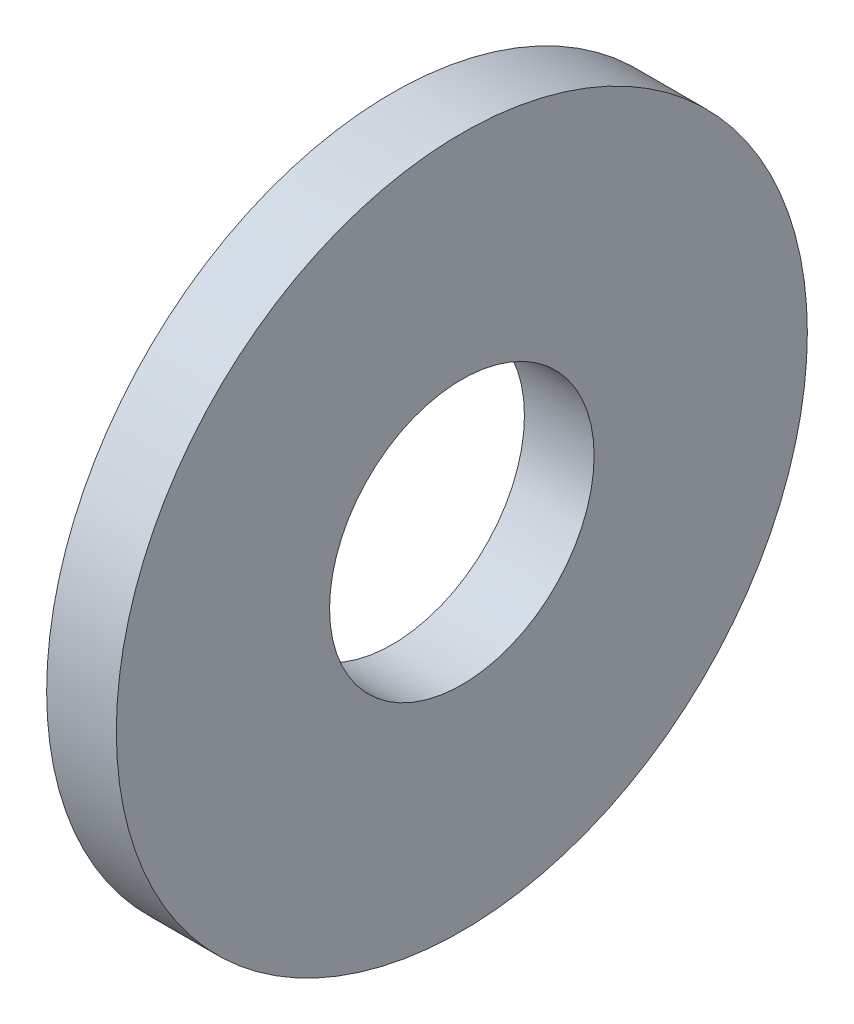
ISO-10303-21;
HEADER;
FILE_DESCRIPTION(('STEP AP214'),'2;1');
FILE_NAME('part.step','',(''),(''),'','','');
FILE_SCHEMA(('AUTOMOTIVE_DESIGN { 1 0 10303 214 1 1 1 1 }'));
ENDSEC;
DATA;
#1=APPLICATION_CONTEXT('core data for automotive mechanical design processes');
#2=APPLICATION_PROTOCOL_DEFINITION('international standard','automotive_design',2000,#1);
#3=PRODUCT_CONTEXT('',#1,'mechanical');
#4=PRODUCT('Part','Part','',(#3));
#5=PRODUCT_RELATED_PRODUCT_CATEGORY('part','',(#4));
#6=PRODUCT_DEFINITION_FORMATION('','',#4);
#7=PRODUCT_DEFINITION_CONTEXT('part definition',#1,'design');
#8=PRODUCT_DEFINITION('design','',#6,#7);
#9=PRODUCT_DEFINITION_SHAPE('','',#8);
#10=(LENGTH_UNIT() NAMED_UNIT(*) SI_UNIT(.MILLI.,.METRE.));
#11=(NAMED_UNIT(*) PLANE_ANGLE_UNIT() SI_UNIT($,.RADIAN.));
#12=(NAMED_UNIT(*) SI_UNIT($,.STERADIAN.) SOLID_ANGLE_UNIT());
#13=UNCERTAINTY_MEASURE_WITH_UNIT(LENGTH_MEASURE(1.E-05),#10,'distance_accuracy_value','');
#14=(GEOMETRIC_REPRESENTATION_CONTEXT(3) GLOBAL_UNCERTAINTY_ASSIGNED_CONTEXT((#13)) GLOBAL_UNIT_ASSIGNED_CONTEXT((#10,
#11,#12)) REPRESENTATION_CONTEXT('',''));
#15=CARTESIAN_POINT('',(0.,0.,0.));
#16=DIRECTION('',(0.,0.,1.));
#17=DIRECTION('',(1.,0.,0.));
#18=AXIS2_PLACEMENT_3D('',#15,#16,#17);
#19=CARTESIAN_POINT('',(1.8796,0.,0.));
#20=DIRECTION('',(1.,0.,0.));
#21=DIRECTION('',(0.,0.,-1.));
#22=AXIS2_PLACEMENT_3D('',#19,#20,#21);
#23=PLANE('',#22);
#24=CARTESIAN_POINT('',(1.8796,0.,0.));
#25=DIRECTION('',(1.,0.,0.));
#26=DIRECTION('',(0.,0.,-1.));
#27=AXIS2_PLACEMENT_3D('',#24,#25,#26);
#28=CIRCLE('',#27,9.3218);
#29=CARTESIAN_POINT('',(1.8796,0.,-9.3218));
#30=VERTEX_POINT('',#29);
#31=EDGE_CURVE('E10',#30,#30,#28,.T.);
#32=ORIENTED_EDGE('',*,*,#31,.T.);
#33=EDGE_LOOP('',(#32));
#34=FACE_BOUND('',#33,.T.);
#35=CARTESIAN_POINT('',(1.8796,0.,0.));
#36=DIRECTION('',(1.,0.,0.));
#37=DIRECTION('',(0.,0.,-1.));
#38=AXIS2_PLACEMENT_3D('',#35,#36,#37);
#39=CIRCLE('',#38,3.5687);
#40=CARTESIAN_POINT('',(1.8796,0.,-3.5687));
#41=VERTEX_POINT('',#40);
#42=EDGE_CURVE('E41',#41,#41,#39,.T.);
#43=ORIENTED_EDGE('',*,*,#42,.F.);
#44=EDGE_LOOP('',(#43));
#45=FACE_BOUND('',#44,.T.);
#46=ADVANCED_FACE('F30',(#34,#45),#23,.T.);
#47=CARTESIAN_POINT('',(0.,0.,0.));
#48=DIRECTION('',(1.,0.,0.));
#49=DIRECTION('',(0.,0.,-1.));
#50=AXIS2_PLACEMENT_3D('',#47,#48,#49);
#51=PLANE('',#50);
#52=CARTESIAN_POINT('',(0.,0.,0.));
#53=DIRECTION('',(1.,0.,0.));
#54=DIRECTION('',(0.,0.,-1.));
#55=AXIS2_PLACEMENT_3D('',#52,#53,#54);
#56=CIRCLE('',#55,9.3218);
#57=CARTESIAN_POINT('',(0.,0.,-9.3218));
#58=VERTEX_POINT('',#57);
#59=EDGE_CURVE('E34',#58,#58,#56,.T.);
#60=ORIENTED_EDGE('',*,*,#59,.F.);
#61=EDGE_LOOP('',(#60));
#62=FACE_BOUND('',#61,.T.);
#63=CARTESIAN_POINT('',(0.,0.,0.));
#64=DIRECTION('',(1.,0.,0.));
#65=DIRECTION('',(0.,0.,-1.));
#66=AXIS2_PLACEMENT_3D('',#63,#64,#65);
#67=CIRCLE('',#66,3.5687);
#68=CARTESIAN_POINT('',(0.,0.,-3.5687));
#69=VERTEX_POINT('',#68);
#70=EDGE_CURVE('E43',#69,#69,#67,.T.);
#71=ORIENTED_EDGE('',*,*,#70,.T.);
#72=EDGE_LOOP('',(#71));
#73=FACE_BOUND('',#72,.T.);
#74=ADVANCED_FACE('F53',(#62,#73),#51,.F.);
#75=CARTESIAN_POINT('',(1.8796,0.,0.));
#76=DIRECTION('',(-1.,0.,0.));
#77=DIRECTION('',(0.,0.,1.));
#78=AXIS2_PLACEMENT_3D('',#75,#76,#77);
#79=CYLINDRICAL_SURFACE('',#78,9.3218);
#80=ORIENTED_EDGE('',*,*,#31,.F.);
#81=EDGE_LOOP('',(#80));
#82=FACE_BOUND('',#81,.T.);
#83=ORIENTED_EDGE('',*,*,#59,.T.);
#84=EDGE_LOOP('',(#83));
#85=FACE_BOUND('',#84,.T.);
#86=ADVANCED_FACE('F32',(#82,#85),#79,.T.);
#87=CARTESIAN_POINT('',(1.8796,0.,0.));
#88=DIRECTION('',(-1.,0.,0.));
#89=DIRECTION('',(0.,0.,1.));
#90=AXIS2_PLACEMENT_3D('',#87,#88,#89);
#91=CYLINDRICAL_SURFACE('',#90,3.5687);
#92=ORIENTED_EDGE('',*,*,#42,.T.);
#93=EDGE_LOOP('',(#92));
#94=FACE_BOUND('',#93,.T.);
#95=ORIENTED_EDGE('',*,*,#70,.F.);
#96=EDGE_LOOP('',(#95));
#97=FACE_BOUND('',#96,.T.);
#98=ADVANCED_FACE('F49',(#94,#97),#91,.F.);
#99=CLOSED_SHELL('',(#46,#74,#86,#98));
#100=MANIFOLD_SOLID_BREP('B2',#99);
#101=ADVANCED_BREP_SHAPE_REPRESENTATION('',(#18,#100),#14);
#102=SHAPE_DEFINITION_REPRESENTATION(#9,#101);
ENDSEC;
END-ISO-10303-21;
